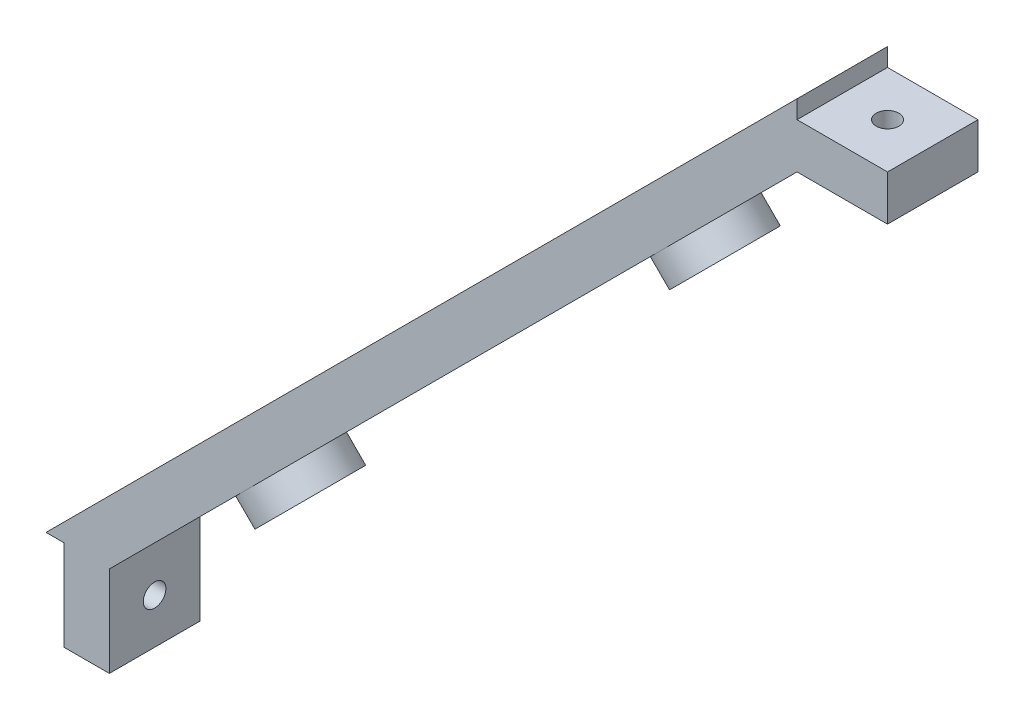
ISO-10303-21;
HEADER;
FILE_DESCRIPTION(('STEP AP214'),'2;1');
FILE_NAME('part.step','',(''),(''),'','','');
FILE_SCHEMA(('AUTOMOTIVE_DESIGN { 1 0 10303 214 1 1 1 1 }'));
ENDSEC;
DATA;
#1=APPLICATION_CONTEXT('core data for automotive mechanical design processes');
#2=APPLICATION_PROTOCOL_DEFINITION('international standard','automotive_design',2000,#1);
#3=PRODUCT_CONTEXT('',#1,'mechanical');
#4=PRODUCT('Part','Part','',(#3));
#5=PRODUCT_RELATED_PRODUCT_CATEGORY('part','',(#4));
#6=PRODUCT_DEFINITION_FORMATION('','',#4);
#7=PRODUCT_DEFINITION_CONTEXT('part definition',#1,'design');
#8=PRODUCT_DEFINITION('design','',#6,#7);
#9=PRODUCT_DEFINITION_SHAPE('','',#8);
#10=(LENGTH_UNIT() NAMED_UNIT(*) SI_UNIT(.MILLI.,.METRE.));
#11=(NAMED_UNIT(*) PLANE_ANGLE_UNIT() SI_UNIT($,.RADIAN.));
#12=(NAMED_UNIT(*) SI_UNIT($,.STERADIAN.) SOLID_ANGLE_UNIT());
#13=UNCERTAINTY_MEASURE_WITH_UNIT(LENGTH_MEASURE(1.E-05),#10,'distance_accuracy_value','');
#14=(GEOMETRIC_REPRESENTATION_CONTEXT(3) GLOBAL_UNCERTAINTY_ASSIGNED_CONTEXT((#13)) GLOBAL_UNIT_ASSIGNED_CONTEXT((#10,
#11,#12)) REPRESENTATION_CONTEXT('',''));
#15=CARTESIAN_POINT('',(0.,0.,0.));
#16=DIRECTION('',(0.,0.,1.));
#17=DIRECTION('',(1.,0.,0.));
#18=AXIS2_PLACEMENT_3D('',#15,#16,#17);
#19=CARTESIAN_POINT('',(-34.5,-41.5000000000001,5.));
#20=DIRECTION('',(-0.707106781186549,0.707106781186546,0.));
#21=DIRECTION('',(-0.707106781186546,-0.707106781186549,0.));
#22=AXIS2_PLACEMENT_3D('',#19,#20,#21);
#23=PLANE('',#22);
#24=CARTESIAN_POINT('',(31.7842712474618,24.784271247462,0.));
#25=DIRECTION('',(-0.707106781186549,0.707106781186546,0.));
#26=DIRECTION('',(-0.707106781186546,-0.707106781186549,0.));
#27=AXIS2_PLACEMENT_3D('',#24,#25,#26);
#28=CIRCLE('',#27,1.25);
#29=CARTESIAN_POINT('',(30.9003877709787,23.9003877709788,0.));
#30=VERTEX_POINT('',#29);
#31=EDGE_CURVE('E205',#30,#30,#28,.T.);
#32=ORIENTED_EDGE('',*,*,#31,.T.);
#33=EDGE_LOOP('',(#32));
#34=FACE_BOUND('',#33,.T.);
#35=DIRECTION('',(0.707106781186546,0.707106781186549,0.));
#36=VECTOR('',#35,1.);
#37=CARTESIAN_POINT('',(-34.5,-41.5000000000001,5.));
#38=LINE('',#37,#36);
#39=CARTESIAN_POINT('',(26.4102597104441,19.4102597104442,5.));
#40=VERTEX_POINT('',#39);
#41=CARTESIAN_POINT('',(41.5,34.5000000000001,5.));
#42=VERTEX_POINT('',#41);
#43=EDGE_CURVE('E133',#40,#42,#38,.T.);
#44=ORIENTED_EDGE('',*,*,#43,.F.);
#45=CARTESIAN_POINT('',(26.4102597104441,19.4102597104442,0.));
#46=DIRECTION('',(-0.707106781186549,0.707106781186546,0.));
#47=DIRECTION('',(-0.707106781186546,-0.707106781186549,0.));
#48=AXIS2_PLACEMENT_3D('',#45,#46,#47);
#49=CIRCLE('',#48,5.);
#50=CARTESIAN_POINT('',(26.4102597104441,19.4102597104442,-5.));
#51=VERTEX_POINT('',#50);
#52=EDGE_CURVE('E48',#40,#51,#49,.T.);
#53=ORIENTED_EDGE('',*,*,#52,.T.);
#54=DIRECTION('',(0.707106781186546,0.707106781186549,0.));
#55=VECTOR('',#54,1.);
#56=CARTESIAN_POINT('',(-34.5,-41.5000000000001,-5.));
#57=LINE('',#56,#55);
#58=CARTESIAN_POINT('',(41.5,34.5000000000001,-5.));
#59=VERTEX_POINT('',#58);
#60=EDGE_CURVE('E131',#51,#59,#57,.T.);
#61=ORIENTED_EDGE('',*,*,#60,.T.);
#62=DIRECTION('',(0.,0.,-1.));
#63=VECTOR('',#62,1.);
#64=CARTESIAN_POINT('',(41.5,34.5000000000001,5.));
#65=LINE('',#64,#63);
#66=EDGE_CURVE('E179',#42,#59,#65,.T.);
#67=ORIENTED_EDGE('',*,*,#66,.F.);
#68=EDGE_LOOP('',(#44,#53,#61,#67));
#69=FACE_BOUND('',#68,.T.);
#70=ADVANCED_FACE('F34',(#34,#69),#23,.F.);
#71=CARTESIAN_POINT('',(-10.6421356237309,-17.642135623731,0.));
#72=DIRECTION('',(-0.707106781186549,0.707106781186546,0.));
#73=DIRECTION('',(-0.707106781186546,-0.707106781186549,0.));
#74=AXIS2_PLACEMENT_3D('',#71,#72,#73);
#75=CIRCLE('',#74,1.25);
#76=CARTESIAN_POINT('',(-11.5260191002141,-18.5260191002141,0.));
#77=VERTEX_POINT('',#76);
#78=EDGE_CURVE('E211',#77,#77,#75,.T.);
#79=ORIENTED_EDGE('',*,*,#78,.T.);
#80=EDGE_LOOP('',(#79));
#81=FACE_BOUND('',#80,.T.);
#82=CARTESIAN_POINT('',(3.49999999999999,-3.49999999999998,0.));
#83=DIRECTION('',(-0.707106781186549,0.707106781186546,0.));
#84=DIRECTION('',(-0.707106781186546,-0.707106781186549,0.));
#85=AXIS2_PLACEMENT_3D('',#82,#83,#84);
#86=CIRCLE('',#85,1.25);
#87=CARTESIAN_POINT('',(2.61611652351681,-4.38388347648317,0.));
#88=VERTEX_POINT('',#87);
#89=EDGE_CURVE('E193',#88,#88,#86,.T.);
#90=ORIENTED_EDGE('',*,*,#89,.T.);
#91=EDGE_LOOP('',(#90));
#92=FACE_BOUND('',#91,.T.);
#93=CARTESIAN_POINT('',(17.6421356237309,10.642135623731,0.));
#94=DIRECTION('',(-0.707106781186549,0.707106781186546,0.));
#95=DIRECTION('',(-0.707106781186546,-0.707106781186549,0.));
#96=AXIS2_PLACEMENT_3D('',#93,#94,#95);
#97=CIRCLE('',#96,1.25);
#98=CARTESIAN_POINT('',(16.7582521472477,9.75825214724781,0.));
#99=VERTEX_POINT('',#98);
#100=EDGE_CURVE('E310',#99,#99,#97,.T.);
#101=ORIENTED_EDGE('',*,*,#100,.T.);
#102=EDGE_LOOP('',(#101));
#103=FACE_BOUND('',#102,.T.);
#104=CARTESIAN_POINT('',(-19.4102597104441,-26.4102597104442,-5.));
#105=VERTEX_POINT('',#104);
#106=EDGE_CURVE('E142',#105,#51,#57,.T.);
#107=ORIENTED_EDGE('',*,*,#106,.T.);
#108=EDGE_CURVE('E120',#51,#40,#49,.T.);
#109=ORIENTED_EDGE('',*,*,#108,.T.);
#110=CARTESIAN_POINT('',(-19.4102597104441,-26.4102597104442,5.));
#111=VERTEX_POINT('',#110);
#112=EDGE_CURVE('E293',#111,#40,#38,.T.);
#113=ORIENTED_EDGE('',*,*,#112,.F.);
#114=CARTESIAN_POINT('',(-19.4102597104441,-26.4102597104442,0.));
#115=DIRECTION('',(-0.707106781186549,0.707106781186546,0.));
#116=DIRECTION('',(-0.707106781186546,-0.707106781186549,0.));
#117=AXIS2_PLACEMENT_3D('',#114,#115,#116);
#118=CIRCLE('',#117,5.);
#119=EDGE_CURVE('E55',#111,#105,#118,.T.);
#120=ORIENTED_EDGE('',*,*,#119,.T.);
#121=EDGE_LOOP('',(#107,#109,#113,#120));
#122=FACE_BOUND('',#121,.T.);
#123=ADVANCED_FACE('F149',(#81,#92,#103,#122),#23,.F.);
#124=CARTESIAN_POINT('',(-69.784271247462,13.215728752538,0.));
#125=DIRECTION('',(0.707106781186549,-0.707106781186546,0.));
#126=DIRECTION('',(0.707106781186546,0.707106781186549,0.));
#127=AXIS2_PLACEMENT_3D('',#124,#125,#126);
#128=CYLINDRICAL_SURFACE('',#127,1.25);
#129=CARTESIAN_POINT('',(-24.7842712474619,-31.7842712474619,0.));
#130=DIRECTION('',(-0.707106781186549,0.707106781186546,0.));
#131=DIRECTION('',(-0.707106781186546,-0.707106781186549,0.));
#132=AXIS2_PLACEMENT_3D('',#129,#130,#131);
#133=CIRCLE('',#132,1.25);
#134=CARTESIAN_POINT('',(-25.668154723945,-32.6681547239451,0.));
#135=VERTEX_POINT('',#134);
#136=EDGE_CURVE('E42',#135,#135,#133,.T.);
#137=ORIENTED_EDGE('',*,*,#136,.F.);
#138=EDGE_LOOP('',(#137));
#139=FACE_BOUND('',#138,.T.);
#140=CARTESIAN_POINT('',(-28.2842712474619,-28.2842712474619,0.));
#141=DIRECTION('',(0.707106781186549,-0.707106781186546,0.));
#142=DIRECTION('',(0.707106781186546,0.707106781186549,0.));
#143=AXIS2_PLACEMENT_3D('',#140,#141,#142);
#144=CIRCLE('',#143,1.25);
#145=CARTESIAN_POINT('',(-27.4003877709787,-27.4003877709788,0.));
#146=VERTEX_POINT('',#145);
#147=EDGE_CURVE('E11',#146,#146,#144,.F.);
#148=ORIENTED_EDGE('',*,*,#147,.T.);
#149=EDGE_LOOP('',(#148));
#150=FACE_BOUND('',#149,.T.);
#151=ADVANCED_FACE('F36',(#139,#150),#128,.F.);
#152=CARTESIAN_POINT('',(-55.6421356237311,27.357864376269,0.));
#153=DIRECTION('',(0.707106781186549,-0.707106781186546,0.));
#154=DIRECTION('',(0.707106781186546,0.707106781186549,0.));
#155=AXIS2_PLACEMENT_3D('',#152,#153,#154);
#156=CYLINDRICAL_SURFACE('',#155,1.25);
#157=ORIENTED_EDGE('',*,*,#78,.F.);
#158=EDGE_LOOP('',(#157));
#159=FACE_BOUND('',#158,.T.);
#160=CARTESIAN_POINT('',(-14.1421356237309,-14.142135623731,0.));
#161=DIRECTION('',(0.707106781186549,-0.707106781186546,0.));
#162=DIRECTION('',(0.707106781186546,0.707106781186549,0.));
#163=AXIS2_PLACEMENT_3D('',#160,#161,#162);
#164=CIRCLE('',#163,1.25);
#165=CARTESIAN_POINT('',(-13.2582521472478,-13.2582521472478,0.));
#166=VERTEX_POINT('',#165);
#167=EDGE_CURVE('E214',#166,#166,#164,.F.);
#168=ORIENTED_EDGE('',*,*,#167,.T.);
#169=EDGE_LOOP('',(#168));
#170=FACE_BOUND('',#169,.T.);
#171=ADVANCED_FACE('F223',(#159,#170),#156,.F.);
#172=CARTESIAN_POINT('',(-41.5000000000001,41.5,0.));
#173=DIRECTION('',(0.707106781186549,-0.707106781186546,0.));
#174=DIRECTION('',(0.707106781186546,0.707106781186549,0.));
#175=AXIS2_PLACEMENT_3D('',#172,#173,#174);
#176=CYLINDRICAL_SURFACE('',#175,1.25);
#177=ORIENTED_EDGE('',*,*,#89,.F.);
#178=EDGE_LOOP('',(#177));
#179=FACE_BOUND('',#178,.T.);
#180=CARTESIAN_POINT('',(0.,0.,0.));
#181=DIRECTION('',(0.707106781186549,-0.707106781186546,0.));
#182=DIRECTION('',(0.707106781186546,0.707106781186549,0.));
#183=AXIS2_PLACEMENT_3D('',#180,#181,#182);
#184=CIRCLE('',#183,1.25);
#185=CARTESIAN_POINT('',(0.883883476483159,0.883883476483205,0.));
#186=VERTEX_POINT('',#185);
#187=EDGE_CURVE('E208',#186,#186,#184,.F.);
#188=ORIENTED_EDGE('',*,*,#187,.T.);
#189=EDGE_LOOP('',(#188));
#190=FACE_BOUND('',#189,.T.);
#191=ADVANCED_FACE('F393',(#179,#190),#176,.F.);
#192=CARTESIAN_POINT('',(-41.5,-41.5000000000001,5.));
#193=DIRECTION('',(0.,1.,0.));
#194=DIRECTION('',(-1.,0.,0.));
#195=AXIS2_PLACEMENT_3D('',#192,#193,#194);
#196=PLANE('',#195);
#197=DIRECTION('',(1.,0.,0.));
#198=VECTOR('',#197,1.);
#199=CARTESIAN_POINT('',(-41.5,-41.5000000000001,-5.));
#200=LINE('',#199,#198);
#201=CARTESIAN_POINT('',(-41.5,-41.5000000000001,-5.));
#202=VERTEX_POINT('',#201);
#203=CARTESIAN_POINT('',(-39.5,-41.5000000000001,-5.));
#204=VERTEX_POINT('',#203);
#205=EDGE_CURVE('E276',#202,#204,#200,.T.);
#206=ORIENTED_EDGE('',*,*,#205,.T.);
#207=DIRECTION('',(0.,0.,-1.));
#208=VECTOR('',#207,1.);
#209=CARTESIAN_POINT('',(-39.5,-41.5000000000001,5.));
#210=LINE('',#209,#208);
#211=CARTESIAN_POINT('',(-39.5,-41.5000000000001,5.));
#212=VERTEX_POINT('',#211);
#213=EDGE_CURVE('E190',#212,#204,#210,.T.);
#214=ORIENTED_EDGE('',*,*,#213,.F.);
#215=DIRECTION('',(1.,0.,0.));
#216=VECTOR('',#215,1.);
#217=CARTESIAN_POINT('',(-41.5,-41.5000000000001,5.));
#218=LINE('',#217,#216);
#219=CARTESIAN_POINT('',(-41.5,-41.5000000000001,5.));
#220=VERTEX_POINT('',#219);
#221=EDGE_CURVE('E162',#220,#212,#218,.T.);
#222=ORIENTED_EDGE('',*,*,#221,.F.);
#223=DIRECTION('',(0.,0.,-1.));
#224=VECTOR('',#223,1.);
#225=CARTESIAN_POINT('',(-41.5,-41.5000000000001,5.));
#226=LINE('',#225,#224);
#227=EDGE_CURVE('E163',#220,#202,#226,.T.);
#228=ORIENTED_EDGE('',*,*,#227,.T.);
#229=EDGE_LOOP('',(#206,#214,#222,#228));
#230=FACE_BOUND('',#229,.T.);
#231=ADVANCED_FACE('F441',(#230),#196,.F.);
#232=CARTESIAN_POINT('',(-39.5,-41.5000000000001,5.));
#233=DIRECTION('',(1.,0.,0.));
#234=DIRECTION('',(0.,0.,-1.));
#235=AXIS2_PLACEMENT_3D('',#232,#233,#234);
#236=PLANE('',#235);
#237=CARTESIAN_POINT('',(-39.5,-46.5000000000001,0.));
#238=DIRECTION('',(1.,0.,0.));
#239=DIRECTION('',(0.,0.,-1.));
#240=AXIS2_PLACEMENT_3D('',#237,#238,#239);
#241=CIRCLE('',#240,1.25);
#242=CARTESIAN_POINT('',(-39.5,-46.5000000000001,-1.25));
#243=VERTEX_POINT('',#242);
#244=EDGE_CURVE('E197',#243,#243,#241,.T.);
#245=ORIENTED_EDGE('',*,*,#244,.T.);
#246=EDGE_LOOP('',(#245));
#247=FACE_BOUND('',#246,.T.);
#248=DIRECTION('',(0.,-1.,0.));
#249=VECTOR('',#248,1.);
#250=CARTESIAN_POINT('',(-39.5,-41.5000000000001,-5.));
#251=LINE('',#250,#249);
#252=CARTESIAN_POINT('',(-39.5,-51.5000000000001,-5.));
#253=VERTEX_POINT('',#252);
#254=EDGE_CURVE('E273',#204,#253,#251,.T.);
#255=ORIENTED_EDGE('',*,*,#254,.T.);
#256=DIRECTION('',(0.,0.,-1.));
#257=VECTOR('',#256,1.);
#258=CARTESIAN_POINT('',(-39.5,-51.5000000000001,5.));
#259=LINE('',#258,#257);
#260=CARTESIAN_POINT('',(-39.5,-51.5000000000001,5.));
#261=VERTEX_POINT('',#260);
#262=EDGE_CURVE('E187',#261,#253,#259,.T.);
#263=ORIENTED_EDGE('',*,*,#262,.F.);
#264=DIRECTION('',(0.,-1.,0.));
#265=VECTOR('',#264,1.);
#266=CARTESIAN_POINT('',(-39.5,-41.5000000000001,5.));
#267=LINE('',#266,#265);
#268=EDGE_CURVE('E298',#212,#261,#267,.T.);
#269=ORIENTED_EDGE('',*,*,#268,.F.);
#270=ORIENTED_EDGE('',*,*,#213,.T.);
#271=EDGE_LOOP('',(#255,#263,#269,#270));
#272=FACE_BOUND('',#271,.T.);
#273=ADVANCED_FACE('F446',(#247,#272),#236,.F.);
#274=CARTESIAN_POINT('',(-39.5,-51.5000000000001,5.));
#275=DIRECTION('',(0.,1.,0.));
#276=DIRECTION('',(0.,0.,1.));
#277=AXIS2_PLACEMENT_3D('',#274,#275,#276);
#278=PLANE('',#277);
#279=DIRECTION('',(1.,0.,0.));
#280=VECTOR('',#279,1.);
#281=CARTESIAN_POINT('',(-39.5,-51.5000000000001,-5.));
#282=LINE('',#281,#280);
#283=CARTESIAN_POINT('',(-34.5,-51.5000000000001,-5.));
#284=VERTEX_POINT('',#283);
#285=EDGE_CURVE('E271',#253,#284,#282,.T.);
#286=ORIENTED_EDGE('',*,*,#285,.T.);
#287=DIRECTION('',(0.,0.,-1.));
#288=VECTOR('',#287,1.);
#289=CARTESIAN_POINT('',(-34.5,-51.5000000000001,5.));
#290=LINE('',#289,#288);
#291=CARTESIAN_POINT('',(-34.5,-51.5000000000001,5.));
#292=VERTEX_POINT('',#291);
#293=EDGE_CURVE('E184',#292,#284,#290,.T.);
#294=ORIENTED_EDGE('',*,*,#293,.F.);
#295=DIRECTION('',(1.,0.,0.));
#296=VECTOR('',#295,1.);
#297=CARTESIAN_POINT('',(-39.5,-51.5000000000001,5.));
#298=LINE('',#297,#296);
#299=EDGE_CURVE('E296',#261,#292,#298,.T.);
#300=ORIENTED_EDGE('',*,*,#299,.F.);
#301=ORIENTED_EDGE('',*,*,#262,.T.);
#302=EDGE_LOOP('',(#286,#294,#300,#301));
#303=FACE_BOUND('',#302,.T.);
#304=ADVANCED_FACE('F264',(#303),#278,.F.);
#305=CARTESIAN_POINT('',(-34.5,-51.5000000000001,5.));
#306=DIRECTION('',(-1.,0.,0.));
#307=DIRECTION('',(0.,0.,1.));
#308=AXIS2_PLACEMENT_3D('',#305,#306,#307);
#309=PLANE('',#308);
#310=CARTESIAN_POINT('',(-34.5,-46.5000000000001,0.));
#311=DIRECTION('',(-1.,0.,0.));
#312=DIRECTION('',(0.,0.,1.));
#313=AXIS2_PLACEMENT_3D('',#310,#311,#312);
#314=CIRCLE('',#313,1.25);
#315=CARTESIAN_POINT('',(-34.5,-46.5000000000001,1.25));
#316=VERTEX_POINT('',#315);
#317=EDGE_CURVE('E194',#316,#316,#314,.T.);
#318=ORIENTED_EDGE('',*,*,#317,.T.);
#319=EDGE_LOOP('',(#318));
#320=FACE_BOUND('',#319,.T.);
#321=DIRECTION('',(0.,1.,0.));
#322=VECTOR('',#321,1.);
#323=CARTESIAN_POINT('',(-34.5,-51.5000000000001,-5.));
#324=LINE('',#323,#322);
#325=CARTESIAN_POINT('',(-34.5,-41.5000000000001,-5.));
#326=VERTEX_POINT('',#325);
#327=EDGE_CURVE('E146',#284,#326,#324,.T.);
#328=ORIENTED_EDGE('',*,*,#327,.T.);
#329=DIRECTION('',(0.,0.,-1.));
#330=VECTOR('',#329,1.);
#331=CARTESIAN_POINT('',(-34.5,-41.5000000000001,5.));
#332=LINE('',#331,#330);
#333=CARTESIAN_POINT('',(-34.5,-41.5000000000001,5.));
#334=VERTEX_POINT('',#333);
#335=EDGE_CURVE('E181',#334,#326,#332,.T.);
#336=ORIENTED_EDGE('',*,*,#335,.F.);
#337=DIRECTION('',(0.,1.,0.));
#338=VECTOR('',#337,1.);
#339=CARTESIAN_POINT('',(-34.5,-51.5000000000001,5.));
#340=LINE('',#339,#338);
#341=EDGE_CURVE('E294',#292,#334,#340,.T.);
#342=ORIENTED_EDGE('',*,*,#341,.F.);
#343=ORIENTED_EDGE('',*,*,#293,.T.);
#344=EDGE_LOOP('',(#328,#336,#342,#343));
#345=FACE_BOUND('',#344,.T.);
#346=ADVANCED_FACE('F256',(#320,#345),#309,.F.);
#347=EDGE_CURVE('E148',#326,#105,#57,.T.);
#348=ORIENTED_EDGE('',*,*,#347,.T.);
#349=EDGE_CURVE('E267',#105,#111,#118,.T.);
#350=ORIENTED_EDGE('',*,*,#349,.T.);
#351=EDGE_CURVE('E290',#334,#111,#38,.T.);
#352=ORIENTED_EDGE('',*,*,#351,.F.);
#353=ORIENTED_EDGE('',*,*,#335,.T.);
#354=EDGE_LOOP('',(#348,#350,#352,#353));
#355=FACE_BOUND('',#354,.T.);
#356=ORIENTED_EDGE('',*,*,#136,.T.);
#357=EDGE_LOOP('',(#356));
#358=FACE_BOUND('',#357,.T.);
#359=ADVANCED_FACE('F219',(#355,#358),#23,.F.);
#360=CARTESIAN_POINT('',(41.5,34.5000000000001,5.));
#361=DIRECTION('',(0.,1.,0.));
#362=DIRECTION('',(0.,0.,1.));
#363=AXIS2_PLACEMENT_3D('',#360,#361,#362);
#364=PLANE('',#363);
#365=CARTESIAN_POINT('',(46.5,34.5000000000001,0.));
#366=DIRECTION('',(0.,1.,0.));
#367=DIRECTION('',(0.,0.,1.));
#368=AXIS2_PLACEMENT_3D('',#365,#366,#367);
#369=CIRCLE('',#368,1.25);
#370=CARTESIAN_POINT('',(46.5,34.5000000000001,1.25));
#371=VERTEX_POINT('',#370);
#372=EDGE_CURVE('E198',#371,#371,#369,.T.);
#373=ORIENTED_EDGE('',*,*,#372,.T.);
#374=EDGE_LOOP('',(#373));
#375=FACE_BOUND('',#374,.T.);
#376=DIRECTION('',(1.,0.,0.));
#377=VECTOR('',#376,1.);
#378=CARTESIAN_POINT('',(41.5,34.5000000000001,-5.));
#379=LINE('',#378,#377);
#380=CARTESIAN_POINT('',(51.5,34.5000000000001,-5.));
#381=VERTEX_POINT('',#380);
#382=EDGE_CURVE('E145',#59,#381,#379,.T.);
#383=ORIENTED_EDGE('',*,*,#382,.T.);
#384=DIRECTION('',(0.,0.,-1.));
#385=VECTOR('',#384,1.);
#386=CARTESIAN_POINT('',(51.5,34.5000000000001,5.));
#387=LINE('',#386,#385);
#388=CARTESIAN_POINT('',(51.5,34.5000000000001,5.));
#389=VERTEX_POINT('',#388);
#390=EDGE_CURVE('E176',#389,#381,#387,.T.);
#391=ORIENTED_EDGE('',*,*,#390,.F.);
#392=DIRECTION('',(1.,0.,0.));
#393=VECTOR('',#392,1.);
#394=CARTESIAN_POINT('',(41.5,34.5000000000001,5.));
#395=LINE('',#394,#393);
#396=EDGE_CURVE('E288',#42,#389,#395,.T.);
#397=ORIENTED_EDGE('',*,*,#396,.F.);
#398=ORIENTED_EDGE('',*,*,#66,.T.);
#399=EDGE_LOOP('',(#383,#391,#397,#398));
#400=FACE_BOUND('',#399,.T.);
#401=ADVANCED_FACE('F255',(#375,#400),#364,.F.);
#402=CARTESIAN_POINT('',(51.5,39.5000000000001,5.));
#403=DIRECTION('',(-1.,0.,0.));
#404=DIRECTION('',(0.,0.,1.));
#405=AXIS2_PLACEMENT_3D('',#402,#403,#404);
#406=PLANE('',#405);
#407=DIRECTION('',(0.,1.,0.));
#408=VECTOR('',#407,1.);
#409=CARTESIAN_POINT('',(51.5,39.5000000000001,-5.));
#410=LINE('',#409,#408);
#411=CARTESIAN_POINT('',(51.5,39.5000000000001,-5.));
#412=VERTEX_POINT('',#411);
#413=EDGE_CURVE('E154',#381,#412,#410,.T.);
#414=ORIENTED_EDGE('',*,*,#413,.T.);
#415=DIRECTION('',(0.,0.,-1.));
#416=VECTOR('',#415,1.);
#417=CARTESIAN_POINT('',(51.5,39.5000000000001,5.));
#418=LINE('',#417,#416);
#419=CARTESIAN_POINT('',(51.5,39.5000000000001,5.));
#420=VERTEX_POINT('',#419);
#421=EDGE_CURVE('E173',#420,#412,#418,.T.);
#422=ORIENTED_EDGE('',*,*,#421,.F.);
#423=DIRECTION('',(0.,1.,0.));
#424=VECTOR('',#423,1.);
#425=CARTESIAN_POINT('',(51.5,39.5000000000001,5.));
#426=LINE('',#425,#424);
#427=EDGE_CURVE('E286',#389,#420,#426,.T.);
#428=ORIENTED_EDGE('',*,*,#427,.F.);
#429=ORIENTED_EDGE('',*,*,#390,.T.);
#430=EDGE_LOOP('',(#414,#422,#428,#429));
#431=FACE_BOUND('',#430,.T.);
#432=ADVANCED_FACE('F262',(#431),#406,.F.);
#433=CARTESIAN_POINT('',(41.5,39.5000000000001,5.));
#434=DIRECTION('',(0.,-1.,0.));
#435=DIRECTION('',(1.,0.,0.));
#436=AXIS2_PLACEMENT_3D('',#433,#434,#435);
#437=PLANE('',#436);
#438=CARTESIAN_POINT('',(46.5,39.5000000000001,0.));
#439=DIRECTION('',(0.,-1.,0.));
#440=DIRECTION('',(1.,0.,0.));
#441=AXIS2_PLACEMENT_3D('',#438,#439,#440);
#442=CIRCLE('',#441,1.25);
#443=CARTESIAN_POINT('',(47.75,39.5000000000001,0.));
#444=VERTEX_POINT('',#443);
#445=EDGE_CURVE('E199',#444,#444,#442,.T.);
#446=ORIENTED_EDGE('',*,*,#445,.T.);
#447=EDGE_LOOP('',(#446));
#448=FACE_BOUND('',#447,.T.);
#449=DIRECTION('',(-1.,0.,0.));
#450=VECTOR('',#449,1.);
#451=CARTESIAN_POINT('',(41.5,39.5000000000001,-5.));
#452=LINE('',#451,#450);
#453=CARTESIAN_POINT('',(41.5,39.5000000000001,-5.));
#454=VERTEX_POINT('',#453);
#455=EDGE_CURVE('E156',#412,#454,#452,.T.);
#456=ORIENTED_EDGE('',*,*,#455,.T.);
#457=DIRECTION('',(0.,0.,-1.));
#458=VECTOR('',#457,1.);
#459=CARTESIAN_POINT('',(41.5,39.5000000000001,5.));
#460=LINE('',#459,#458);
#461=CARTESIAN_POINT('',(41.5,39.5000000000001,5.));
#462=VERTEX_POINT('',#461);
#463=EDGE_CURVE('E170',#462,#454,#460,.T.);
#464=ORIENTED_EDGE('',*,*,#463,.F.);
#465=DIRECTION('',(-1.,0.,0.));
#466=VECTOR('',#465,1.);
#467=CARTESIAN_POINT('',(41.5,39.5000000000001,5.));
#468=LINE('',#467,#466);
#469=EDGE_CURVE('E284',#420,#462,#468,.T.);
#470=ORIENTED_EDGE('',*,*,#469,.F.);
#471=ORIENTED_EDGE('',*,*,#421,.T.);
#472=EDGE_LOOP('',(#456,#464,#470,#471));
#473=FACE_BOUND('',#472,.T.);
#474=ADVANCED_FACE('F238',(#448,#473),#437,.F.);
#475=CARTESIAN_POINT('',(41.5,41.5000000000001,5.));
#476=DIRECTION('',(-1.,0.,0.));
#477=DIRECTION('',(0.,-1.,0.));
#478=AXIS2_PLACEMENT_3D('',#475,#476,#477);
#479=PLANE('',#478);
#480=DIRECTION('',(0.,1.,0.));
#481=VECTOR('',#480,1.);
#482=CARTESIAN_POINT('',(41.5,41.5000000000001,-5.));
#483=LINE('',#482,#481);
#484=CARTESIAN_POINT('',(41.5,41.5000000000001,-5.));
#485=VERTEX_POINT('',#484);
#486=EDGE_CURVE('E158',#454,#485,#483,.T.);
#487=ORIENTED_EDGE('',*,*,#486,.T.);
#488=DIRECTION('',(0.,0.,-1.));
#489=VECTOR('',#488,1.);
#490=CARTESIAN_POINT('',(41.5,41.5000000000001,5.));
#491=LINE('',#490,#489);
#492=CARTESIAN_POINT('',(41.5,41.5000000000001,5.));
#493=VERTEX_POINT('',#492);
#494=EDGE_CURVE('E166',#493,#485,#491,.T.);
#495=ORIENTED_EDGE('',*,*,#494,.F.);
#496=DIRECTION('',(0.,1.,0.));
#497=VECTOR('',#496,1.);
#498=CARTESIAN_POINT('',(41.5,41.5000000000001,5.));
#499=LINE('',#498,#497);
#500=EDGE_CURVE('E282',#462,#493,#499,.T.);
#501=ORIENTED_EDGE('',*,*,#500,.F.);
#502=ORIENTED_EDGE('',*,*,#463,.T.);
#503=EDGE_LOOP('',(#487,#495,#501,#502));
#504=FACE_BOUND('',#503,.T.);
#505=ADVANCED_FACE('F229',(#504),#479,.F.);
#506=CARTESIAN_POINT('',(-41.5,-41.5000000000001,5.));
#507=DIRECTION('',(0.707106781186549,-0.707106781186546,0.));
#508=DIRECTION('',(0.707106781186546,0.707106781186549,0.));
#509=AXIS2_PLACEMENT_3D('',#506,#507,#508);
#510=PLANE('',#509);
#511=CARTESIAN_POINT('',(-22.9102597104441,-22.9102597104442,0.));
#512=DIRECTION('',(0.707106781186549,-0.707106781186546,0.));
#513=DIRECTION('',(0.707106781186546,0.707106781186549,0.));
#514=AXIS2_PLACEMENT_3D('',#511,#512,#513);
#515=CIRCLE('',#514,1.25);
#516=CARTESIAN_POINT('',(-22.0263762339609,-22.026376233961,0.));
#517=VERTEX_POINT('',#516);
#518=EDGE_CURVE('E324',#517,#517,#515,.T.);
#519=ORIENTED_EDGE('',*,*,#518,.T.);
#520=EDGE_LOOP('',(#519));
#521=FACE_BOUND('',#520,.T.);
#522=CARTESIAN_POINT('',(22.9102597104441,22.9102597104442,0.));
#523=DIRECTION('',(0.707106781186549,-0.707106781186546,0.));
#524=DIRECTION('',(0.707106781186546,0.707106781186549,0.));
#525=AXIS2_PLACEMENT_3D('',#522,#523,#524);
#526=CIRCLE('',#525,1.25);
#527=CARTESIAN_POINT('',(23.7941431869273,23.7941431869274,0.));
#528=VERTEX_POINT('',#527);
#529=EDGE_CURVE('E126',#528,#528,#526,.T.);
#530=ORIENTED_EDGE('',*,*,#529,.T.);
#531=EDGE_LOOP('',(#530));
#532=FACE_BOUND('',#531,.T.);
#533=CARTESIAN_POINT('',(14.1421356237309,14.142135623731,0.));
#534=DIRECTION('',(0.707106781186549,-0.707106781186546,0.));
#535=DIRECTION('',(0.707106781186546,0.707106781186549,0.));
#536=AXIS2_PLACEMENT_3D('',#533,#534,#535);
#537=CIRCLE('',#536,1.25);
#538=CARTESIAN_POINT('',(15.0260191002141,15.0260191002142,0.));
#539=VERTEX_POINT('',#538);
#540=EDGE_CURVE('E307',#539,#539,#537,.F.);
#541=ORIENTED_EDGE('',*,*,#540,.F.);
#542=EDGE_LOOP('',(#541));
#543=FACE_BOUND('',#542,.T.);
#544=CARTESIAN_POINT('',(28.2842712474618,28.284271247462,0.));
#545=DIRECTION('',(0.707106781186549,-0.707106781186546,0.));
#546=DIRECTION('',(0.707106781186546,0.707106781186549,0.));
#547=AXIS2_PLACEMENT_3D('',#544,#545,#546);
#548=CIRCLE('',#547,1.25);
#549=CARTESIAN_POINT('',(29.168154723945,29.1681547239452,0.));
#550=VERTEX_POINT('',#549);
#551=EDGE_CURVE('E202',#550,#550,#548,.F.);
#552=ORIENTED_EDGE('',*,*,#551,.F.);
#553=EDGE_LOOP('',(#552));
#554=FACE_BOUND('',#553,.T.);
#555=DIRECTION('',(-0.707106781186546,-0.707106781186549,0.));
#556=VECTOR('',#555,1.);
#557=CARTESIAN_POINT('',(-41.5,-41.5000000000001,-5.));
#558=LINE('',#557,#556);
#559=EDGE_CURVE('E160',#485,#202,#558,.T.);
#560=ORIENTED_EDGE('',*,*,#559,.T.);
#561=ORIENTED_EDGE('',*,*,#227,.F.);
#562=DIRECTION('',(-0.707106781186546,-0.707106781186549,0.));
#563=VECTOR('',#562,1.);
#564=CARTESIAN_POINT('',(-41.5,-41.5000000000001,5.));
#565=LINE('',#564,#563);
#566=EDGE_CURVE('E167',#493,#220,#565,.T.);
#567=ORIENTED_EDGE('',*,*,#566,.F.);
#568=ORIENTED_EDGE('',*,*,#494,.T.);
#569=EDGE_LOOP('',(#560,#561,#567,#568));
#570=FACE_BOUND('',#569,.T.);
#571=ORIENTED_EDGE('',*,*,#187,.F.);
#572=EDGE_LOOP('',(#571));
#573=FACE_BOUND('',#572,.T.);
#574=ORIENTED_EDGE('',*,*,#167,.F.);
#575=EDGE_LOOP('',(#574));
#576=FACE_BOUND('',#575,.T.);
#577=ORIENTED_EDGE('',*,*,#147,.F.);
#578=EDGE_LOOP('',(#577));
#579=FACE_BOUND('',#578,.T.);
#580=ADVANCED_FACE('F226',(#521,#532,#543,#554,#570,#573,#576,#579),#510,.F.);
#581=CARTESIAN_POINT('',(0.,0.,5.));
#582=DIRECTION('',(0.,0.,-1.));
#583=DIRECTION('',(-1.,0.,0.));
#584=AXIS2_PLACEMENT_3D('',#581,#582,#583);
#585=PLANE('',#584);
#586=ORIENTED_EDGE('',*,*,#221,.T.);
#587=ORIENTED_EDGE('',*,*,#268,.T.);
#588=ORIENTED_EDGE('',*,*,#299,.T.);
#589=ORIENTED_EDGE('',*,*,#341,.T.);
#590=ORIENTED_EDGE('',*,*,#351,.T.);
#591=ORIENTED_EDGE('',*,*,#112,.T.);
#592=ORIENTED_EDGE('',*,*,#43,.T.);
#593=ORIENTED_EDGE('',*,*,#396,.T.);
#594=ORIENTED_EDGE('',*,*,#427,.T.);
#595=ORIENTED_EDGE('',*,*,#469,.T.);
#596=ORIENTED_EDGE('',*,*,#500,.T.);
#597=ORIENTED_EDGE('',*,*,#566,.T.);
#598=EDGE_LOOP('',(#586,#587,#588,#589,#590,#591,#592,#593,#594,#595,#596,#597));
#599=FACE_BOUND('',#598,.T.);
#600=ADVANCED_FACE('F228',(#599),#585,.F.);
#601=CARTESIAN_POINT('',(0.,0.,-5.));
#602=DIRECTION('',(0.,0.,-1.));
#603=DIRECTION('',(-1.,0.,0.));
#604=AXIS2_PLACEMENT_3D('',#601,#602,#603);
#605=PLANE('',#604);
#606=ORIENTED_EDGE('',*,*,#205,.F.);
#607=ORIENTED_EDGE('',*,*,#559,.F.);
#608=ORIENTED_EDGE('',*,*,#486,.F.);
#609=ORIENTED_EDGE('',*,*,#455,.F.);
#610=ORIENTED_EDGE('',*,*,#413,.F.);
#611=ORIENTED_EDGE('',*,*,#382,.F.);
#612=ORIENTED_EDGE('',*,*,#60,.F.);
#613=ORIENTED_EDGE('',*,*,#106,.F.);
#614=ORIENTED_EDGE('',*,*,#347,.F.);
#615=ORIENTED_EDGE('',*,*,#327,.F.);
#616=ORIENTED_EDGE('',*,*,#285,.F.);
#617=ORIENTED_EDGE('',*,*,#254,.F.);
#618=EDGE_LOOP('',(#606,#607,#608,#609,#610,#611,#612,#613,#614,#615,#616,#617));
#619=FACE_BOUND('',#618,.T.);
#620=ADVANCED_FACE('F140',(#619),#605,.T.);
#621=CARTESIAN_POINT('',(-41.5,-46.5000000000001,0.));
#622=DIRECTION('',(1.,0.,0.));
#623=DIRECTION('',(0.,1.,0.));
#624=AXIS2_PLACEMENT_3D('',#621,#622,#623);
#625=CYLINDRICAL_SURFACE('',#624,1.25);
#626=ORIENTED_EDGE('',*,*,#317,.F.);
#627=EDGE_LOOP('',(#626));
#628=FACE_BOUND('',#627,.T.);
#629=ORIENTED_EDGE('',*,*,#244,.F.);
#630=EDGE_LOOP('',(#629));
#631=FACE_BOUND('',#630,.T.);
#632=ADVANCED_FACE('F357',(#628,#631),#625,.F.);
#633=CARTESIAN_POINT('',(46.5,41.5000000000001,0.));
#634=DIRECTION('',(0.,-1.,0.));
#635=DIRECTION('',(0.,0.,-1.));
#636=AXIS2_PLACEMENT_3D('',#633,#634,#635);
#637=CYLINDRICAL_SURFACE('',#636,1.25);
#638=ORIENTED_EDGE('',*,*,#445,.F.);
#639=EDGE_LOOP('',(#638));
#640=FACE_BOUND('',#639,.T.);
#641=ORIENTED_EDGE('',*,*,#372,.F.);
#642=EDGE_LOOP('',(#641));
#643=FACE_BOUND('',#642,.T.);
#644=ADVANCED_FACE('F353',(#640,#643),#637,.F.);
#645=CARTESIAN_POINT('',(-13.2157287525383,69.7842712474619,0.));
#646=DIRECTION('',(0.707106781186549,-0.707106781186546,0.));
#647=DIRECTION('',(0.707106781186546,0.707106781186549,0.));
#648=AXIS2_PLACEMENT_3D('',#645,#646,#647);
#649=CYLINDRICAL_SURFACE('',#648,1.25);
#650=ORIENTED_EDGE('',*,*,#31,.F.);
#651=EDGE_LOOP('',(#650));
#652=FACE_BOUND('',#651,.T.);
#653=ORIENTED_EDGE('',*,*,#551,.T.);
#654=EDGE_LOOP('',(#653));
#655=FACE_BOUND('',#654,.T.);
#656=ADVANCED_FACE('F346',(#652,#655),#649,.F.);
#657=CARTESIAN_POINT('',(-27.3578643762692,55.6421356237309,0.));
#658=DIRECTION('',(0.707106781186549,-0.707106781186546,0.));
#659=DIRECTION('',(0.707106781186546,0.707106781186549,0.));
#660=AXIS2_PLACEMENT_3D('',#657,#658,#659);
#661=CYLINDRICAL_SURFACE('',#660,1.25);
#662=ORIENTED_EDGE('',*,*,#100,.F.);
#663=EDGE_LOOP('',(#662));
#664=FACE_BOUND('',#663,.T.);
#665=ORIENTED_EDGE('',*,*,#540,.T.);
#666=EDGE_LOOP('',(#665));
#667=FACE_BOUND('',#666,.T.);
#668=ADVANCED_FACE('F341',(#664,#667),#661,.F.);
#669=CARTESIAN_POINT('',(-17.2889393668845,-28.5315800540038,0.));
#670=DIRECTION('',(-0.707106781186549,0.707106781186546,0.));
#671=DIRECTION('',(-0.707106781186546,-0.707106781186549,0.));
#672=AXIS2_PLACEMENT_3D('',#669,#670,#671);
#673=CYLINDRICAL_SURFACE('',#672,5.);
#674=CARTESIAN_POINT('',(-17.2889393668845,-28.5315800540038,0.));
#675=DIRECTION('',(-0.707106781186549,0.707106781186546,0.));
#676=DIRECTION('',(-0.707106781186546,-0.707106781186549,0.));
#677=AXIS2_PLACEMENT_3D('',#674,#675,#676);
#678=CIRCLE('',#677,5.);
#679=CARTESIAN_POINT('',(-20.8244732728172,-32.0671139599365,0.));
#680=VERTEX_POINT('',#679);
#681=EDGE_CURVE('E313',#680,#680,#678,.T.);
#682=ORIENTED_EDGE('',*,*,#681,.T.);
#683=EDGE_LOOP('',(#682));
#684=FACE_BOUND('',#683,.T.);
#685=ORIENTED_EDGE('',*,*,#119,.F.);
#686=ORIENTED_EDGE('',*,*,#349,.F.);
#687=EDGE_LOOP('',(#685,#686));
#688=FACE_BOUND('',#687,.T.);
#689=ADVANCED_FACE('F336',(#684,#688),#673,.T.);
#690=CARTESIAN_POINT('',(-17.2889393668845,-28.5315800540038,0.));
#691=DIRECTION('',(-0.707106781186549,0.707106781186546,0.));
#692=DIRECTION('',(-0.707106781186546,-0.707106781186549,0.));
#693=AXIS2_PLACEMENT_3D('',#690,#691,#692);
#694=PLANE('',#693);
#695=CARTESIAN_POINT('',(-17.2889393668845,-28.5315800540038,0.));
#696=DIRECTION('',(0.707106781186549,-0.707106781186546,0.));
#697=DIRECTION('',(0.707106781186546,0.707106781186549,0.));
#698=AXIS2_PLACEMENT_3D('',#695,#696,#697);
#699=CIRCLE('',#698,1.25);
#700=CARTESIAN_POINT('',(-16.4050558904013,-27.6476965775206,0.));
#701=VERTEX_POINT('',#700);
#702=EDGE_CURVE('E326',#701,#701,#699,.T.);
#703=ORIENTED_EDGE('',*,*,#702,.F.);
#704=EDGE_LOOP('',(#703));
#705=FACE_BOUND('',#704,.T.);
#706=ORIENTED_EDGE('',*,*,#681,.F.);
#707=EDGE_LOOP('',(#706));
#708=FACE_BOUND('',#707,.T.);
#709=ADVANCED_FACE('F333',(#705,#708),#694,.F.);
#710=CARTESIAN_POINT('',(28.5315800540037,17.2889393668846,0.));
#711=DIRECTION('',(-0.707106781186549,0.707106781186546,0.));
#712=DIRECTION('',(-0.707106781186546,-0.707106781186549,0.));
#713=AXIS2_PLACEMENT_3D('',#710,#711,#712);
#714=CYLINDRICAL_SURFACE('',#713,5.);
#715=CARTESIAN_POINT('',(28.5315800540037,17.2889393668846,0.));
#716=DIRECTION('',(-0.707106781186549,0.707106781186546,0.));
#717=DIRECTION('',(-0.707106781186546,-0.707106781186549,0.));
#718=AXIS2_PLACEMENT_3D('',#715,#716,#717);
#719=CIRCLE('',#718,5.);
#720=CARTESIAN_POINT('',(24.996046148071,13.7534054609518,0.));
#721=VERTEX_POINT('',#720);
#722=EDGE_CURVE('E135',#721,#721,#719,.T.);
#723=ORIENTED_EDGE('',*,*,#722,.T.);
#724=EDGE_LOOP('',(#723));
#725=FACE_BOUND('',#724,.T.);
#726=ORIENTED_EDGE('',*,*,#52,.F.);
#727=ORIENTED_EDGE('',*,*,#108,.F.);
#728=EDGE_LOOP('',(#726,#727));
#729=FACE_BOUND('',#728,.T.);
#730=ADVANCED_FACE('F121',(#725,#729),#714,.T.);
#731=CARTESIAN_POINT('',(28.5315800540037,17.2889393668846,0.));
#732=DIRECTION('',(-0.707106781186549,0.707106781186546,0.));
#733=DIRECTION('',(-0.707106781186546,-0.707106781186549,0.));
#734=AXIS2_PLACEMENT_3D('',#731,#732,#733);
#735=PLANE('',#734);
#736=CARTESIAN_POINT('',(28.5315800540037,17.2889393668846,0.));
#737=DIRECTION('',(0.707106781186549,-0.707106781186546,0.));
#738=DIRECTION('',(0.707106781186546,0.707106781186549,0.));
#739=AXIS2_PLACEMENT_3D('',#736,#737,#738);
#740=CIRCLE('',#739,1.25);
#741=CARTESIAN_POINT('',(29.4154635304869,18.1728228433678,0.));
#742=VERTEX_POINT('',#741);
#743=EDGE_CURVE('E321',#742,#742,#740,.T.);
#744=ORIENTED_EDGE('',*,*,#743,.F.);
#745=EDGE_LOOP('',(#744));
#746=FACE_BOUND('',#745,.T.);
#747=ORIENTED_EDGE('',*,*,#722,.F.);
#748=EDGE_LOOP('',(#747));
#749=FACE_BOUND('',#748,.T.);
#750=ADVANCED_FACE('F560',(#746,#749),#735,.F.);
#751=CARTESIAN_POINT('',(-18.589740289556,64.4102597104442,0.));
#752=DIRECTION('',(0.707106781186549,-0.707106781186546,0.));
#753=DIRECTION('',(0.707106781186546,0.707106781186549,0.));
#754=AXIS2_PLACEMENT_3D('',#751,#752,#753);
#755=CYLINDRICAL_SURFACE('',#754,1.25);
#756=ORIENTED_EDGE('',*,*,#743,.T.);
#757=EDGE_LOOP('',(#756));
#758=FACE_BOUND('',#757,.T.);
#759=ORIENTED_EDGE('',*,*,#529,.F.);
#760=EDGE_LOOP('',(#759));
#761=FACE_BOUND('',#760,.T.);
#762=ADVANCED_FACE('F565',(#758,#761),#755,.F.);
#763=CARTESIAN_POINT('',(-64.4102597104442,18.5897402895558,0.));
#764=DIRECTION('',(0.707106781186549,-0.707106781186546,0.));
#765=DIRECTION('',(0.707106781186546,0.707106781186549,0.));
#766=AXIS2_PLACEMENT_3D('',#763,#764,#765);
#767=CYLINDRICAL_SURFACE('',#766,1.25);
#768=ORIENTED_EDGE('',*,*,#702,.T.);
#769=EDGE_LOOP('',(#768));
#770=FACE_BOUND('',#769,.T.);
#771=ORIENTED_EDGE('',*,*,#518,.F.);
#772=EDGE_LOOP('',(#771));
#773=FACE_BOUND('',#772,.T.);
#774=ADVANCED_FACE('F330',(#770,#773),#767,.F.);
#775=CLOSED_SHELL('',(#70,#123,#151,#171,#191,#231,#273,#304,#346,#359,#401,#432,#474,#505,#580,
#600,#620,#632,#644,#656,#668,#689,#709,#730,#750,#762,#774));
#776=MANIFOLD_SOLID_BREP('B2',#775);
#777=ADVANCED_BREP_SHAPE_REPRESENTATION('',(#18,#776),#14);
#778=SHAPE_DEFINITION_REPRESENTATION(#9,#777);
ENDSEC;
END-ISO-10303-21;
